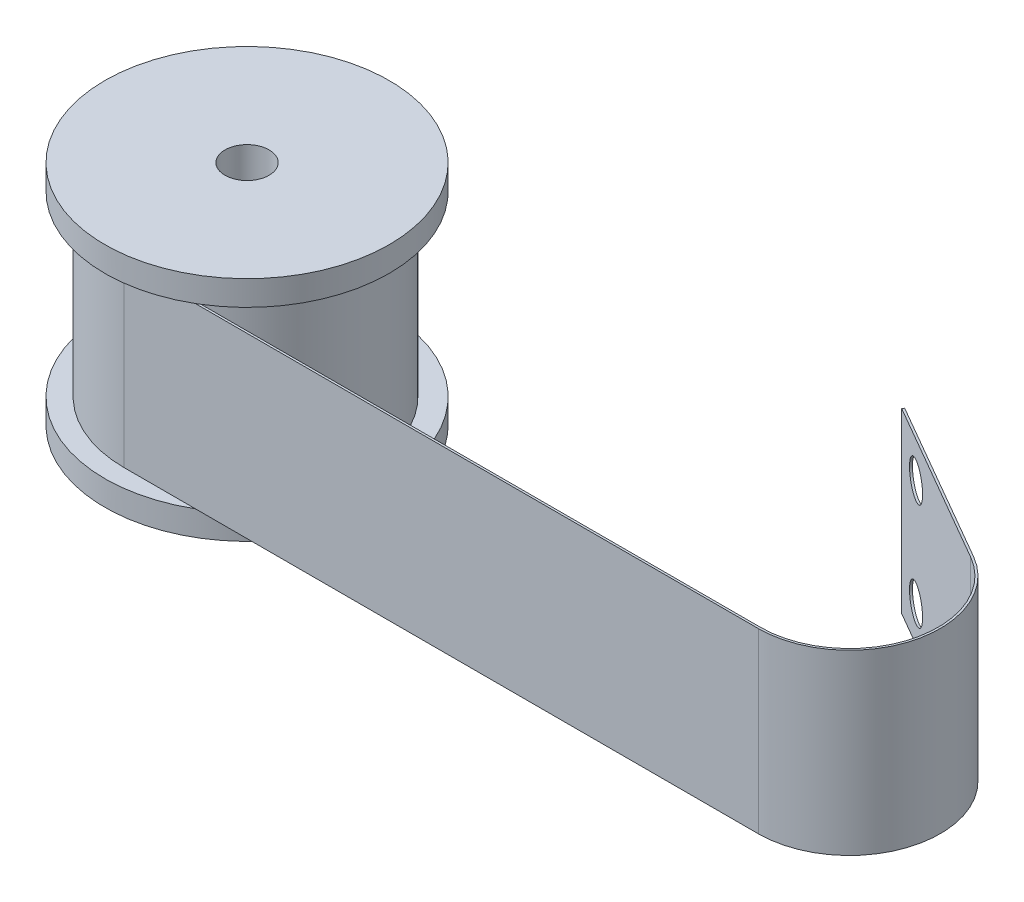
ISO-10303-21;
HEADER;
FILE_DESCRIPTION(('STEP AP214'),'2;1');
FILE_NAME('part.step','',(''),(''),'','','');
FILE_SCHEMA(('AUTOMOTIVE_DESIGN { 1 0 10303 214 1 1 1 1 }'));
ENDSEC;
DATA;
#1=APPLICATION_CONTEXT('core data for automotive mechanical design processes');
#2=APPLICATION_PROTOCOL_DEFINITION('international standard','automotive_design',2000,#1);
#3=PRODUCT_CONTEXT('',#1,'mechanical');
#4=PRODUCT('Part','Part','',(#3));
#5=PRODUCT_RELATED_PRODUCT_CATEGORY('part','',(#4));
#6=PRODUCT_DEFINITION_FORMATION('','',#4);
#7=PRODUCT_DEFINITION_CONTEXT('part definition',#1,'design');
#8=PRODUCT_DEFINITION('design','',#6,#7);
#9=PRODUCT_DEFINITION_SHAPE('','',#8);
#10=(LENGTH_UNIT() NAMED_UNIT(*) SI_UNIT(.MILLI.,.METRE.));
#11=(NAMED_UNIT(*) PLANE_ANGLE_UNIT() SI_UNIT($,.RADIAN.));
#12=(NAMED_UNIT(*) SI_UNIT($,.STERADIAN.) SOLID_ANGLE_UNIT());
#13=UNCERTAINTY_MEASURE_WITH_UNIT(LENGTH_MEASURE(1.E-05),#10,'distance_accuracy_value','');
#14=(GEOMETRIC_REPRESENTATION_CONTEXT(3) GLOBAL_UNCERTAINTY_ASSIGNED_CONTEXT((#13)) GLOBAL_UNIT_ASSIGNED_CONTEXT((#10,
#11,#12)) REPRESENTATION_CONTEXT('',''));
#15=CARTESIAN_POINT('',(0.,0.,0.));
#16=DIRECTION('',(0.,0.,1.));
#17=DIRECTION('',(1.,0.,0.));
#18=AXIS2_PLACEMENT_3D('',#15,#16,#17);
#19=CARTESIAN_POINT('',(17.,-12.5,0.));
#20=DIRECTION('',(0.,1.,0.));
#21=DIRECTION('',(-1.,0.,0.));
#22=AXIS2_PLACEMENT_3D('',#19,#20,#21);
#23=PLANE('',#22);
#24=CARTESIAN_POINT('',(0.,-12.5,0.));
#25=DIRECTION('',(0.,-1.,0.));
#26=DIRECTION('',(1.,0.,0.));
#27=AXIS2_PLACEMENT_3D('',#24,#25,#26);
#28=CIRCLE('',#27,20.);
#29=CARTESIAN_POINT('',(10.0354372102067,-12.4999999999999,17.3));
#30=VERTEX_POINT('',#29);
#31=CARTESIAN_POINT('',(10.5356537528528,-12.4999999999999,17.));
#32=VERTEX_POINT('',#31);
#33=EDGE_CURVE('E245',#30,#32,#28,.T.);
#34=ORIENTED_EDGE('',*,*,#33,.F.);
#35=DIRECTION('',(1.,0.,0.));
#36=VECTOR('',#35,1.);
#37=CARTESIAN_POINT('',(0.,-12.5000000000001,17.3));
#38=LINE('',#37,#36);
#39=CARTESIAN_POINT('',(0.,-12.5000000000001,17.3));
#40=VERTEX_POINT('',#39);
#41=EDGE_CURVE('E67',#40,#30,#38,.T.);
#42=ORIENTED_EDGE('',*,*,#41,.F.);
#43=CARTESIAN_POINT('',(0.,-12.5000000000001,0.));
#44=DIRECTION('',(0.,1.,0.));
#45=DIRECTION('',(1.,0.,0.));
#46=AXIS2_PLACEMENT_3D('',#43,#44,#45);
#47=CIRCLE('',#46,17.3);
#48=CARTESIAN_POINT('',(0.,-12.5000000000001,-17.3));
#49=VERTEX_POINT('',#48);
#50=EDGE_CURVE('E72',#49,#40,#47,.T.);
#51=ORIENTED_EDGE('',*,*,#50,.F.);
#52=DIRECTION('',(0.,0.,1.));
#53=VECTOR('',#52,1.);
#54=CARTESIAN_POINT('',(0.,-12.5000000000001,-17.3));
#55=LINE('',#54,#53);
#56=CARTESIAN_POINT('',(0.,-12.5,-17.));
#57=VERTEX_POINT('',#56);
#58=EDGE_CURVE('E184',#49,#57,#55,.T.);
#59=ORIENTED_EDGE('',*,*,#58,.T.);
#60=CARTESIAN_POINT('',(0.,-12.5,0.));
#61=DIRECTION('',(0.,-1.,0.));
#62=DIRECTION('',(1.,0.,0.));
#63=AXIS2_PLACEMENT_3D('',#60,#61,#62);
#64=CIRCLE('',#63,17.);
#65=CARTESIAN_POINT('',(0.,-12.5,17.));
#66=VERTEX_POINT('',#65);
#67=EDGE_CURVE('E241',#57,#66,#64,.T.);
#68=ORIENTED_EDGE('',*,*,#67,.T.);
#69=DIRECTION('',(1.,0.,0.));
#70=VECTOR('',#69,1.);
#71=CARTESIAN_POINT('',(0.,-12.5000000000001,17.));
#72=LINE('',#71,#70);
#73=EDGE_CURVE('E181',#66,#32,#72,.T.);
#74=ORIENTED_EDGE('',*,*,#73,.T.);
#75=EDGE_LOOP('',(#34,#42,#51,#59,#68,#74));
#76=FACE_BOUND('',#75,.T.);
#77=ADVANCED_FACE('F51',(#76),#23,.T.);
#78=CARTESIAN_POINT('',(17.,12.5,0.));
#79=DIRECTION('',(0.,-1.,0.));
#80=DIRECTION('',(1.,0.,0.));
#81=AXIS2_PLACEMENT_3D('',#78,#79,#80);
#82=PLANE('',#81);
#83=CARTESIAN_POINT('',(0.,12.4999999999999,0.));
#84=DIRECTION('',(0.,-1.,0.));
#85=DIRECTION('',(1.,0.,0.));
#86=AXIS2_PLACEMENT_3D('',#83,#84,#85);
#87=CIRCLE('',#86,17.3);
#88=CARTESIAN_POINT('',(0.,12.4999999999999,17.3));
#89=VERTEX_POINT('',#88);
#90=CARTESIAN_POINT('',(0.,12.4999999999999,-17.3));
#91=VERTEX_POINT('',#90);
#92=EDGE_CURVE('E359',#89,#91,#87,.T.);
#93=ORIENTED_EDGE('',*,*,#92,.F.);
#94=DIRECTION('',(-1.,0.,0.));
#95=VECTOR('',#94,1.);
#96=CARTESIAN_POINT('',(0.,12.4999999999999,17.3));
#97=LINE('',#96,#95);
#98=CARTESIAN_POINT('',(10.0354372102068,12.5,17.3));
#99=VERTEX_POINT('',#98);
#100=EDGE_CURVE('E226',#99,#89,#97,.T.);
#101=ORIENTED_EDGE('',*,*,#100,.F.);
#102=CARTESIAN_POINT('',(0.,12.5,0.));
#103=DIRECTION('',(0.,-1.,0.));
#104=DIRECTION('',(1.,0.,0.));
#105=AXIS2_PLACEMENT_3D('',#102,#103,#104);
#106=CIRCLE('',#105,20.);
#107=CARTESIAN_POINT('',(10.5356537528528,12.5,17.));
#108=VERTEX_POINT('',#107);
#109=EDGE_CURVE('E231',#99,#108,#106,.T.);
#110=ORIENTED_EDGE('',*,*,#109,.T.);
#111=DIRECTION('',(-1.,0.,0.));
#112=VECTOR('',#111,1.);
#113=CARTESIAN_POINT('',(0.,12.4999999999999,17.));
#114=LINE('',#113,#112);
#115=CARTESIAN_POINT('',(0.,12.5,17.));
#116=VERTEX_POINT('',#115);
#117=EDGE_CURVE('E366',#108,#116,#114,.T.);
#118=ORIENTED_EDGE('',*,*,#117,.T.);
#119=CARTESIAN_POINT('',(0.,12.5,0.));
#120=DIRECTION('',(0.,-1.,0.));
#121=DIRECTION('',(1.,0.,0.));
#122=AXIS2_PLACEMENT_3D('',#119,#120,#121);
#123=CIRCLE('',#122,17.);
#124=CARTESIAN_POINT('',(0.,12.5,-17.));
#125=VERTEX_POINT('',#124);
#126=EDGE_CURVE('E237',#125,#116,#123,.T.);
#127=ORIENTED_EDGE('',*,*,#126,.F.);
#128=DIRECTION('',(0.,0.,-1.));
#129=VECTOR('',#128,1.);
#130=CARTESIAN_POINT('',(0.,12.4999999999999,-17.3));
#131=LINE('',#130,#129);
#132=EDGE_CURVE('E363',#125,#91,#131,.T.);
#133=ORIENTED_EDGE('',*,*,#132,.T.);
#134=EDGE_LOOP('',(#93,#101,#110,#118,#127,#133));
#135=FACE_BOUND('',#134,.T.);
#136=ADVANCED_FACE('F273',(#135),#82,.T.);
#137=CARTESIAN_POINT('',(20.,16.,0.));
#138=DIRECTION('',(0.,1.,0.));
#139=DIRECTION('',(-1.,0.,0.));
#140=AXIS2_PLACEMENT_3D('',#137,#138,#139);
#141=PLANE('',#140);
#142=CARTESIAN_POINT('',(0.,16.,0.));
#143=DIRECTION('',(0.,-1.,0.));
#144=DIRECTION('',(1.,0.,0.));
#145=AXIS2_PLACEMENT_3D('',#142,#143,#144);
#146=CIRCLE('',#145,3.10000000000006);
#147=CARTESIAN_POINT('',(3.1,16.,0.));
#148=VERTEX_POINT('',#147);
#149=EDGE_CURVE('E11',#148,#148,#146,.T.);
#150=ORIENTED_EDGE('',*,*,#149,.T.);
#151=EDGE_LOOP('',(#150));
#152=FACE_BOUND('',#151,.T.);
#153=CARTESIAN_POINT('',(0.,16.,0.));
#154=DIRECTION('',(0.,-1.,0.));
#155=DIRECTION('',(1.,0.,0.));
#156=AXIS2_PLACEMENT_3D('',#153,#154,#155);
#157=CIRCLE('',#156,20.0000000000001);
#158=CARTESIAN_POINT('',(20.,16.0000000000001,0.));
#159=VERTEX_POINT('',#158);
#160=EDGE_CURVE('E227',#159,#159,#157,.T.);
#161=ORIENTED_EDGE('',*,*,#160,.F.);
#162=EDGE_LOOP('',(#161));
#163=FACE_BOUND('',#162,.T.);
#164=ADVANCED_FACE('F53',(#152,#163),#141,.T.);
#165=CARTESIAN_POINT('',(4.67799402961668E-12,-1363.74765538485,0.));
#166=DIRECTION('',(0.,-1.,0.));
#167=DIRECTION('',(1.,0.,0.));
#168=AXIS2_PLACEMENT_3D('',#165,#166,#167);
#169=CYLINDRICAL_SURFACE('',#168,3.1);
#170=CARTESIAN_POINT('',(0.,-16.,0.));
#171=DIRECTION('',(0.,-1.,0.));
#172=DIRECTION('',(1.,0.,0.));
#173=AXIS2_PLACEMENT_3D('',#170,#171,#172);
#174=CIRCLE('',#173,3.09999999999995);
#175=CARTESIAN_POINT('',(3.1,-16.,0.));
#176=VERTEX_POINT('',#175);
#177=EDGE_CURVE('E60',#176,#176,#174,.T.);
#178=ORIENTED_EDGE('',*,*,#177,.T.);
#179=EDGE_LOOP('',(#178));
#180=FACE_BOUND('',#179,.T.);
#181=ORIENTED_EDGE('',*,*,#149,.F.);
#182=EDGE_LOOP('',(#181));
#183=FACE_BOUND('',#182,.T.);
#184=ADVANCED_FACE('F257',(#180,#183),#169,.F.);
#185=CARTESIAN_POINT('',(20.,-16.,0.));
#186=DIRECTION('',(0.,-1.,0.));
#187=DIRECTION('',(1.,0.,0.));
#188=AXIS2_PLACEMENT_3D('',#185,#186,#187);
#189=PLANE('',#188);
#190=CARTESIAN_POINT('',(0.,-16.,0.));
#191=DIRECTION('',(0.,-1.,0.));
#192=DIRECTION('',(1.,0.,0.));
#193=AXIS2_PLACEMENT_3D('',#190,#191,#192);
#194=CIRCLE('',#193,19.9999999999999);
#195=CARTESIAN_POINT('',(20.,-15.9999999999999,0.));
#196=VERTEX_POINT('',#195);
#197=EDGE_CURVE('E250',#196,#196,#194,.T.);
#198=ORIENTED_EDGE('',*,*,#197,.T.);
#199=EDGE_LOOP('',(#198));
#200=FACE_BOUND('',#199,.T.);
#201=ORIENTED_EDGE('',*,*,#177,.F.);
#202=EDGE_LOOP('',(#201));
#203=FACE_BOUND('',#202,.T.);
#204=ADVANCED_FACE('F260',(#200,#203),#189,.T.);
#205=CARTESIAN_POINT('',(4.67799402961668E-12,-1363.74765538485,0.));
#206=DIRECTION('',(0.,-1.,0.));
#207=DIRECTION('',(1.,0.,0.));
#208=AXIS2_PLACEMENT_3D('',#205,#206,#207);
#209=CYLINDRICAL_SURFACE('',#208,20.);
#210=EDGE_CURVE('E246',#32,#30,#28,.T.);
#211=ORIENTED_EDGE('',*,*,#210,.T.);
#212=ORIENTED_EDGE('',*,*,#33,.T.);
#213=EDGE_LOOP('',(#211,#212));
#214=FACE_BOUND('',#213,.T.);
#215=ORIENTED_EDGE('',*,*,#197,.F.);
#216=EDGE_LOOP('',(#215));
#217=FACE_BOUND('',#216,.T.);
#218=ADVANCED_FACE('F262',(#214,#217),#209,.T.);
#219=CARTESIAN_POINT('',(4.67799402961668E-12,-1363.74765538485,0.));
#220=DIRECTION('',(0.,-1.,0.));
#221=DIRECTION('',(1.,0.,0.));
#222=AXIS2_PLACEMENT_3D('',#219,#220,#221);
#223=CYLINDRICAL_SURFACE('',#222,17.);
#224=DIRECTION('',(0.,-1.,0.));
#225=VECTOR('',#224,1.);
#226=CARTESIAN_POINT('',(-4.74596916454954E-13,137.446018429063,-17.));
#227=LINE('',#226,#225);
#228=EDGE_CURVE('E207',#125,#57,#227,.T.);
#229=ORIENTED_EDGE('',*,*,#228,.F.);
#230=ORIENTED_EDGE('',*,*,#126,.T.);
#231=DIRECTION('',(0.,-1.,0.));
#232=VECTOR('',#231,1.);
#233=CARTESIAN_POINT('',(-4.71474067117128E-13,137.446018429063,17.));
#234=LINE('',#233,#232);
#235=EDGE_CURVE('E211',#116,#66,#234,.T.);
#236=ORIENTED_EDGE('',*,*,#235,.T.);
#237=ORIENTED_EDGE('',*,*,#67,.F.);
#238=EDGE_LOOP('',(#229,#230,#236,#237));
#239=FACE_BOUND('',#238,.T.);
#240=ADVANCED_FACE('F270',(#239),#223,.T.);
#241=CARTESIAN_POINT('',(4.67799402961668E-12,-1363.74765538485,0.));
#242=DIRECTION('',(0.,-1.,0.));
#243=DIRECTION('',(1.,0.,0.));
#244=AXIS2_PLACEMENT_3D('',#241,#242,#243);
#245=CYLINDRICAL_SURFACE('',#244,20.);
#246=ORIENTED_EDGE('',*,*,#160,.T.);
#247=EDGE_LOOP('',(#246));
#248=FACE_BOUND('',#247,.T.);
#249=EDGE_CURVE('E233',#108,#99,#106,.T.);
#250=ORIENTED_EDGE('',*,*,#249,.F.);
#251=ORIENTED_EDGE('',*,*,#109,.F.);
#252=EDGE_LOOP('',(#250,#251));
#253=FACE_BOUND('',#252,.T.);
#254=ADVANCED_FACE('F282',(#248,#253),#245,.T.);
#255=CARTESIAN_POINT('',(89.2,-12.4999999999998,4.49999999999996));
#256=DIRECTION('',(0.,1.,0.));
#257=DIRECTION('',(1.,0.,0.));
#258=AXIS2_PLACEMENT_3D('',#255,#256,#257);
#259=PLANE('',#258);
#260=ORIENTED_EDGE('',*,*,#210,.F.);
#261=CARTESIAN_POINT('',(89.2,-12.4999999999998,17.));
#262=VERTEX_POINT('',#261);
#263=EDGE_CURVE('E180',#32,#262,#72,.T.);
#264=ORIENTED_EDGE('',*,*,#263,.T.);
#265=CARTESIAN_POINT('',(89.2,-12.4999999999998,4.49999999999996));
#266=DIRECTION('',(0.,1.,0.));
#267=DIRECTION('',(-1.,0.,0.));
#268=AXIS2_PLACEMENT_3D('',#265,#266,#267);
#269=CIRCLE('',#268,12.5);
#270=CARTESIAN_POINT('',(95.45,-12.4999999999997,-6.32531754730556));
#271=VERTEX_POINT('',#270);
#272=EDGE_CURVE('E174',#262,#271,#269,.T.);
#273=ORIENTED_EDGE('',*,*,#272,.T.);
#274=DIRECTION('',(-0.866025403784442,0.,-0.499999999999995));
#275=VECTOR('',#274,1.);
#276=CARTESIAN_POINT('',(95.45,-12.4999999999997,-6.32531754730556));
#277=LINE('',#276,#275);
#278=CARTESIAN_POINT('',(72.5003267997123,-12.4999999999998,-19.5753175473054));
#279=VERTEX_POINT('',#278);
#280=EDGE_CURVE('E170',#271,#279,#277,.T.);
#281=ORIENTED_EDGE('',*,*,#280,.T.);
#282=DIRECTION('',(0.499999999999989,0.,-0.866025403784445));
#283=VECTOR('',#282,1.);
#284=CARTESIAN_POINT('',(72.5003267997123,-12.4999999999998,-19.5753175473054));
#285=LINE('',#284,#283);
#286=CARTESIAN_POINT('',(72.6503267997123,-12.4999999999998,-19.8351251684408));
#287=VERTEX_POINT('',#286);
#288=EDGE_CURVE('E146',#279,#287,#285,.T.);
#289=ORIENTED_EDGE('',*,*,#288,.T.);
#290=DIRECTION('',(-0.866025403784442,0.,-0.499999999999995));
#291=VECTOR('',#290,1.);
#292=CARTESIAN_POINT('',(95.6,-12.4999999999997,-6.58512516844089));
#293=LINE('',#292,#291);
#294=CARTESIAN_POINT('',(95.6,-12.4999999999997,-6.58512516844089));
#295=VERTEX_POINT('',#294);
#296=EDGE_CURVE('E156',#295,#287,#293,.T.);
#297=ORIENTED_EDGE('',*,*,#296,.F.);
#298=CARTESIAN_POINT('',(89.2,-12.4999999999998,4.49999999999996));
#299=DIRECTION('',(0.,1.,0.));
#300=DIRECTION('',(1.,0.,0.));
#301=AXIS2_PLACEMENT_3D('',#298,#299,#300);
#302=CIRCLE('',#301,12.8);
#303=CARTESIAN_POINT('',(89.2,-12.4999999999998,17.3));
#304=VERTEX_POINT('',#303);
#305=EDGE_CURVE('E192',#304,#295,#302,.T.);
#306=ORIENTED_EDGE('',*,*,#305,.F.);
#307=EDGE_CURVE('E189',#30,#304,#38,.T.);
#308=ORIENTED_EDGE('',*,*,#307,.F.);
#309=EDGE_LOOP('',(#260,#264,#273,#281,#289,#297,#306,#308));
#310=FACE_BOUND('',#309,.T.);
#311=ADVANCED_FACE('F167',(#310),#259,.F.);
#312=CARTESIAN_POINT('',(89.1999999999995,137.446018429063,4.49999999999996));
#313=DIRECTION('',(0.,-1.,0.));
#314=DIRECTION('',(1.,0.,0.));
#315=AXIS2_PLACEMENT_3D('',#312,#313,#314);
#316=CYLINDRICAL_SURFACE('',#315,12.8);
#317=DIRECTION('',(0.,-1.,0.));
#318=VECTOR('',#317,1.);
#319=CARTESIAN_POINT('',(95.5999999999995,137.446018429063,-6.58512516844089));
#320=LINE('',#319,#318);
#321=CARTESIAN_POINT('',(95.5999999999998,12.5000000000003,-6.58512516844097));
#322=VERTEX_POINT('',#321);
#323=EDGE_CURVE('E159',#322,#295,#320,.T.);
#324=ORIENTED_EDGE('',*,*,#323,.F.);
#325=CARTESIAN_POINT('',(89.2,12.5000000000002,4.49999999999996));
#326=DIRECTION('',(0.,-1.,0.));
#327=DIRECTION('',(1.,0.,0.));
#328=AXIS2_PLACEMENT_3D('',#325,#326,#327);
#329=CIRCLE('',#328,12.8);
#330=CARTESIAN_POINT('',(89.2,12.5000000000003,17.3));
#331=VERTEX_POINT('',#330);
#332=EDGE_CURVE('E152',#322,#331,#329,.T.);
#333=ORIENTED_EDGE('',*,*,#332,.T.);
#334=DIRECTION('',(0.,-1.,0.));
#335=VECTOR('',#334,1.);
#336=CARTESIAN_POINT('',(89.1999999999995,137.446018429063,17.3));
#337=LINE('',#336,#335);
#338=EDGE_CURVE('E197',#331,#304,#337,.T.);
#339=ORIENTED_EDGE('',*,*,#338,.T.);
#340=ORIENTED_EDGE('',*,*,#305,.T.);
#341=EDGE_LOOP('',(#324,#333,#339,#340));
#342=FACE_BOUND('',#341,.T.);
#343=ADVANCED_FACE('F317',(#342),#316,.T.);
#344=CARTESIAN_POINT('',(-4.71474067117128E-13,137.446018429063,17.3));
#345=DIRECTION('',(0.,0.,-1.));
#346=DIRECTION('',(-1.,0.,0.));
#347=AXIS2_PLACEMENT_3D('',#344,#345,#346);
#348=PLANE('',#347);
#349=ORIENTED_EDGE('',*,*,#338,.F.);
#350=EDGE_CURVE('E355',#331,#99,#97,.T.);
#351=ORIENTED_EDGE('',*,*,#350,.T.);
#352=ORIENTED_EDGE('',*,*,#100,.T.);
#353=DIRECTION('',(0.,-1.,0.));
#354=VECTOR('',#353,1.);
#355=CARTESIAN_POINT('',(-4.71474067117128E-13,137.446018429063,17.3));
#356=LINE('',#355,#354);
#357=EDGE_CURVE('E201',#89,#40,#356,.T.);
#358=ORIENTED_EDGE('',*,*,#357,.T.);
#359=ORIENTED_EDGE('',*,*,#41,.T.);
#360=ORIENTED_EDGE('',*,*,#307,.T.);
#361=EDGE_LOOP('',(#349,#351,#352,#358,#359,#360));
#362=FACE_BOUND('',#361,.T.);
#363=ADVANCED_FACE('F313',(#362),#348,.F.);
#364=CARTESIAN_POINT('',(-4.71474067117128E-13,137.446018429063,0.));
#365=DIRECTION('',(0.,-1.,0.));
#366=DIRECTION('',(1.,0.,0.));
#367=AXIS2_PLACEMENT_3D('',#364,#365,#366);
#368=CYLINDRICAL_SURFACE('',#367,17.3);
#369=ORIENTED_EDGE('',*,*,#357,.F.);
#370=ORIENTED_EDGE('',*,*,#92,.T.);
#371=DIRECTION('',(0.,-1.,0.));
#372=VECTOR('',#371,1.);
#373=CARTESIAN_POINT('',(-4.74256119301068E-13,137.446018429063,-17.3));
#374=LINE('',#373,#372);
#375=EDGE_CURVE('E204',#91,#49,#374,.T.);
#376=ORIENTED_EDGE('',*,*,#375,.T.);
#377=ORIENTED_EDGE('',*,*,#50,.T.);
#378=EDGE_LOOP('',(#369,#370,#376,#377));
#379=FACE_BOUND('',#378,.T.);
#380=ADVANCED_FACE('F309',(#379),#368,.T.);
#381=CARTESIAN_POINT('',(-4.74256119301068E-13,137.446018429063,-17.3));
#382=DIRECTION('',(1.,0.,0.));
#383=DIRECTION('',(0.,1.,0.));
#384=AXIS2_PLACEMENT_3D('',#381,#382,#383);
#385=PLANE('',#384);
#386=ORIENTED_EDGE('',*,*,#132,.F.);
#387=ORIENTED_EDGE('',*,*,#228,.T.);
#388=ORIENTED_EDGE('',*,*,#58,.F.);
#389=ORIENTED_EDGE('',*,*,#375,.F.);
#390=EDGE_LOOP('',(#386,#387,#388,#389));
#391=FACE_BOUND('',#390,.T.);
#392=ADVANCED_FACE('F305',(#391),#385,.T.);
#393=CARTESIAN_POINT('',(-4.71474067117128E-13,137.446018429063,17.));
#394=DIRECTION('',(0.,0.,-1.));
#395=DIRECTION('',(-1.,0.,0.));
#396=AXIS2_PLACEMENT_3D('',#393,#394,#395);
#397=PLANE('',#396);
#398=CARTESIAN_POINT('',(89.2,12.5000000000002,17.));
#399=VERTEX_POINT('',#398);
#400=EDGE_CURVE('E367',#399,#108,#114,.T.);
#401=ORIENTED_EDGE('',*,*,#400,.F.);
#402=DIRECTION('',(0.,-1.,0.));
#403=VECTOR('',#402,1.);
#404=CARTESIAN_POINT('',(89.1999999999995,137.446018429063,17.));
#405=LINE('',#404,#403);
#406=EDGE_CURVE('E214',#399,#262,#405,.T.);
#407=ORIENTED_EDGE('',*,*,#406,.T.);
#408=ORIENTED_EDGE('',*,*,#263,.F.);
#409=ORIENTED_EDGE('',*,*,#73,.F.);
#410=ORIENTED_EDGE('',*,*,#235,.F.);
#411=ORIENTED_EDGE('',*,*,#117,.F.);
#412=EDGE_LOOP('',(#401,#407,#408,#409,#410,#411));
#413=FACE_BOUND('',#412,.T.);
#414=ADVANCED_FACE('F301',(#413),#397,.T.);
#415=CARTESIAN_POINT('',(89.1999999999995,137.446018429063,4.49999999999996));
#416=DIRECTION('',(0.,-1.,0.));
#417=DIRECTION('',(1.,0.,0.));
#418=AXIS2_PLACEMENT_3D('',#415,#416,#417);
#419=CYLINDRICAL_SURFACE('',#418,12.5);
#420=CARTESIAN_POINT('',(89.2,12.5000000000002,4.49999999999996));
#421=DIRECTION('',(0.,-1.,0.));
#422=DIRECTION('',(1.,0.,0.));
#423=AXIS2_PLACEMENT_3D('',#420,#421,#422);
#424=CIRCLE('',#423,12.5);
#425=CARTESIAN_POINT('',(95.4499999999998,12.5000000000003,-6.32531754730563));
#426=VERTEX_POINT('',#425);
#427=EDGE_CURVE('E371',#426,#399,#424,.T.);
#428=ORIENTED_EDGE('',*,*,#427,.F.);
#429=DIRECTION('',(0.,-1.,0.));
#430=VECTOR('',#429,1.);
#431=CARTESIAN_POINT('',(95.4499999999995,137.446018429063,-6.32531754730556));
#432=LINE('',#431,#430);
#433=EDGE_CURVE('E218',#426,#271,#432,.T.);
#434=ORIENTED_EDGE('',*,*,#433,.T.);
#435=ORIENTED_EDGE('',*,*,#272,.F.);
#436=ORIENTED_EDGE('',*,*,#406,.F.);
#437=EDGE_LOOP('',(#428,#434,#435,#436));
#438=FACE_BOUND('',#437,.T.);
#439=ADVANCED_FACE('F297',(#438),#419,.F.);
#440=CARTESIAN_POINT('',(95.4499999999995,137.446018429063,-6.32531754730556));
#441=DIRECTION('',(-0.499999999999995,0.,0.866025403784442));
#442=DIRECTION('',(0.866025403784442,0.,0.499999999999995));
#443=AXIS2_PLACEMENT_3D('',#440,#441,#442);
#444=PLANE('',#443);
#445=CARTESIAN_POINT('',(77.2634665205267,-7.49999999999982,-16.8253175473054));
#446=DIRECTION('',(-0.499999999999995,0.,0.866025403784442));
#447=DIRECTION('',(0.866025403784442,0.,0.499999999999995));
#448=AXIS2_PLACEMENT_3D('',#445,#446,#447);
#449=CIRCLE('',#448,2.5);
#450=CARTESIAN_POINT('',(79.4285300299878,-7.49999999999982,-15.5753175473055));
#451=VERTEX_POINT('',#450);
#452=EDGE_CURVE('E164',#451,#451,#449,.F.);
#453=ORIENTED_EDGE('',*,*,#452,.T.);
#454=EDGE_LOOP('',(#453));
#455=FACE_BOUND('',#454,.T.);
#456=CARTESIAN_POINT('',(77.2634665205267,7.50000000000018,-16.8253175473054));
#457=DIRECTION('',(-0.499999999999995,0.,0.866025403784442));
#458=DIRECTION('',(0.866025403784442,0.,0.499999999999995));
#459=AXIS2_PLACEMENT_3D('',#456,#457,#458);
#460=CIRCLE('',#459,2.5);
#461=CARTESIAN_POINT('',(79.4285300299878,7.50000000000018,-15.5753175473054));
#462=VERTEX_POINT('',#461);
#463=EDGE_CURVE('E348',#462,#462,#460,.F.);
#464=ORIENTED_EDGE('',*,*,#463,.T.);
#465=EDGE_LOOP('',(#464));
#466=FACE_BOUND('',#465,.T.);
#467=DIRECTION('',(0.866025403784442,0.,0.499999999999995));
#468=VECTOR('',#467,1.);
#469=CARTESIAN_POINT('',(95.4499999999999,12.5000000000003,-6.32531754730556));
#470=LINE('',#469,#468);
#471=CARTESIAN_POINT('',(72.5003267997118,12.5000000000002,-19.5753175473057));
#472=VERTEX_POINT('',#471);
#473=EDGE_CURVE('E374',#472,#426,#470,.T.);
#474=ORIENTED_EDGE('',*,*,#473,.F.);
#475=DIRECTION('',(0.,-1.,0.));
#476=VECTOR('',#475,1.);
#477=CARTESIAN_POINT('',(72.5003267997118,137.446018429063,-19.5753175473054));
#478=LINE('',#477,#476);
#479=EDGE_CURVE('E153',#472,#279,#478,.T.);
#480=ORIENTED_EDGE('',*,*,#479,.T.);
#481=ORIENTED_EDGE('',*,*,#280,.F.);
#482=ORIENTED_EDGE('',*,*,#433,.F.);
#483=EDGE_LOOP('',(#474,#480,#481,#482));
#484=FACE_BOUND('',#483,.T.);
#485=ADVANCED_FACE('F294',(#455,#466,#484),#444,.T.);
#486=CARTESIAN_POINT('',(72.5003267997118,137.446018429063,-19.5753175473054));
#487=DIRECTION('',(-0.866025403784445,0.,-0.499999999999989));
#488=DIRECTION('',(-0.499999999999989,0.,0.866025403784445));
#489=AXIS2_PLACEMENT_3D('',#486,#487,#488);
#490=PLANE('',#489);
#491=DIRECTION('',(-0.499999999999989,0.,0.866025403784445));
#492=VECTOR('',#491,1.);
#493=CARTESIAN_POINT('',(72.5003267997122,12.5000000000002,-19.5753175473054));
#494=LINE('',#493,#492);
#495=CARTESIAN_POINT('',(72.6503267997122,12.5000000000002,-19.8351251684408));
#496=VERTEX_POINT('',#495);
#497=EDGE_CURVE('E148',#496,#472,#494,.T.);
#498=ORIENTED_EDGE('',*,*,#497,.F.);
#499=DIRECTION('',(0.,-1.,0.));
#500=VECTOR('',#499,1.);
#501=CARTESIAN_POINT('',(72.6503267997118,137.446018429063,-19.8351251684408));
#502=LINE('',#501,#500);
#503=EDGE_CURVE('E141',#496,#287,#502,.T.);
#504=ORIENTED_EDGE('',*,*,#503,.T.);
#505=ORIENTED_EDGE('',*,*,#288,.F.);
#506=ORIENTED_EDGE('',*,*,#479,.F.);
#507=EDGE_LOOP('',(#498,#504,#505,#506));
#508=FACE_BOUND('',#507,.T.);
#509=ADVANCED_FACE('F143',(#508),#490,.T.);
#510=CARTESIAN_POINT('',(95.5999999999995,137.446018429063,-6.58512516844089));
#511=DIRECTION('',(-0.499999999999995,0.,0.866025403784442));
#512=DIRECTION('',(0.866025403784442,0.,0.499999999999995));
#513=AXIS2_PLACEMENT_3D('',#510,#511,#512);
#514=PLANE('',#513);
#515=CARTESIAN_POINT('',(77.4134665205267,-7.49999999999982,-17.0851251684408));
#516=DIRECTION('',(0.499999999999995,0.,-0.866025403784442));
#517=DIRECTION('',(-0.866025403784442,0.,-0.499999999999995));
#518=AXIS2_PLACEMENT_3D('',#515,#516,#517);
#519=CIRCLE('',#518,2.5);
#520=CARTESIAN_POINT('',(75.2484030110656,-7.49999999999982,-18.3351251684408));
#521=VERTEX_POINT('',#520);
#522=EDGE_CURVE('E339',#521,#521,#519,.T.);
#523=ORIENTED_EDGE('',*,*,#522,.F.);
#524=EDGE_LOOP('',(#523));
#525=FACE_BOUND('',#524,.T.);
#526=CARTESIAN_POINT('',(77.4134665205267,7.50000000000018,-17.0851251684408));
#527=DIRECTION('',(0.499999999999995,0.,-0.866025403784442));
#528=DIRECTION('',(-0.866025403784442,0.,-0.499999999999995));
#529=AXIS2_PLACEMENT_3D('',#526,#527,#528);
#530=CIRCLE('',#529,2.5);
#531=CARTESIAN_POINT('',(75.2484030110656,7.50000000000018,-18.3351251684407));
#532=VERTEX_POINT('',#531);
#533=EDGE_CURVE('E345',#532,#532,#530,.T.);
#534=ORIENTED_EDGE('',*,*,#533,.F.);
#535=EDGE_LOOP('',(#534));
#536=FACE_BOUND('',#535,.T.);
#537=ORIENTED_EDGE('',*,*,#503,.F.);
#538=DIRECTION('',(0.866025403784442,0.,0.499999999999995));
#539=VECTOR('',#538,1.);
#540=CARTESIAN_POINT('',(95.5999999999999,12.5000000000003,-6.58512516844089));
#541=LINE('',#540,#539);
#542=EDGE_CURVE('E232',#496,#322,#541,.T.);
#543=ORIENTED_EDGE('',*,*,#542,.T.);
#544=ORIENTED_EDGE('',*,*,#323,.T.);
#545=ORIENTED_EDGE('',*,*,#296,.T.);
#546=EDGE_LOOP('',(#537,#543,#544,#545));
#547=FACE_BOUND('',#546,.T.);
#548=ADVANCED_FACE('F157',(#525,#536,#547),#514,.F.);
#549=CARTESIAN_POINT('',(17.,12.5,0.));
#550=DIRECTION('',(0.,-1.,0.));
#551=DIRECTION('',(1.,0.,0.));
#552=AXIS2_PLACEMENT_3D('',#549,#550,#551);
#553=PLANE('',#552);
#554=ORIENTED_EDGE('',*,*,#249,.T.);
#555=ORIENTED_EDGE('',*,*,#350,.F.);
#556=ORIENTED_EDGE('',*,*,#332,.F.);
#557=ORIENTED_EDGE('',*,*,#542,.F.);
#558=ORIENTED_EDGE('',*,*,#497,.T.);
#559=ORIENTED_EDGE('',*,*,#473,.T.);
#560=ORIENTED_EDGE('',*,*,#427,.T.);
#561=ORIENTED_EDGE('',*,*,#400,.T.);
#562=EDGE_LOOP('',(#554,#555,#556,#557,#558,#559,#560,#561));
#563=FACE_BOUND('',#562,.T.);
#564=ADVANCED_FACE('F290',(#563),#553,.F.);
#565=CARTESIAN_POINT('',(73.727932614594,7.50000000000017,-10.7015931903474));
#566=DIRECTION('',(0.499999999999995,0.,-0.866025403784442));
#567=DIRECTION('',(-0.866025403784442,0.,-0.499999999999995));
#568=AXIS2_PLACEMENT_3D('',#565,#566,#567);
#569=CYLINDRICAL_SURFACE('',#568,2.5);
#570=ORIENTED_EDGE('',*,*,#533,.T.);
#571=EDGE_LOOP('',(#570));
#572=FACE_BOUND('',#571,.T.);
#573=ORIENTED_EDGE('',*,*,#463,.F.);
#574=EDGE_LOOP('',(#573));
#575=FACE_BOUND('',#574,.T.);
#576=ADVANCED_FACE('F326',(#572,#575),#569,.F.);
#577=CARTESIAN_POINT('',(73.727932614594,-7.49999999999983,-10.7015931903475));
#578=DIRECTION('',(0.499999999999995,0.,-0.866025403784442));
#579=DIRECTION('',(-0.866025403784442,0.,-0.499999999999995));
#580=AXIS2_PLACEMENT_3D('',#577,#578,#579);
#581=CYLINDRICAL_SURFACE('',#580,2.5);
#582=ORIENTED_EDGE('',*,*,#522,.T.);
#583=EDGE_LOOP('',(#582));
#584=FACE_BOUND('',#583,.T.);
#585=ORIENTED_EDGE('',*,*,#452,.F.);
#586=EDGE_LOOP('',(#585));
#587=FACE_BOUND('',#586,.T.);
#588=ADVANCED_FACE('F330',(#584,#587),#581,.F.);
#589=CLOSED_SHELL('',(#77,#136,#164,#184,#204,#218,#240,#254,#311,#343,#363,#380,#392,#414,#439,
#485,#509,#548,#564,#576,#588));
#590=MANIFOLD_SOLID_BREP('B2',#589);
#591=ADVANCED_BREP_SHAPE_REPRESENTATION('',(#18,#590),#14);
#592=SHAPE_DEFINITION_REPRESENTATION(#9,#591);
ENDSEC;
END-ISO-10303-21;
